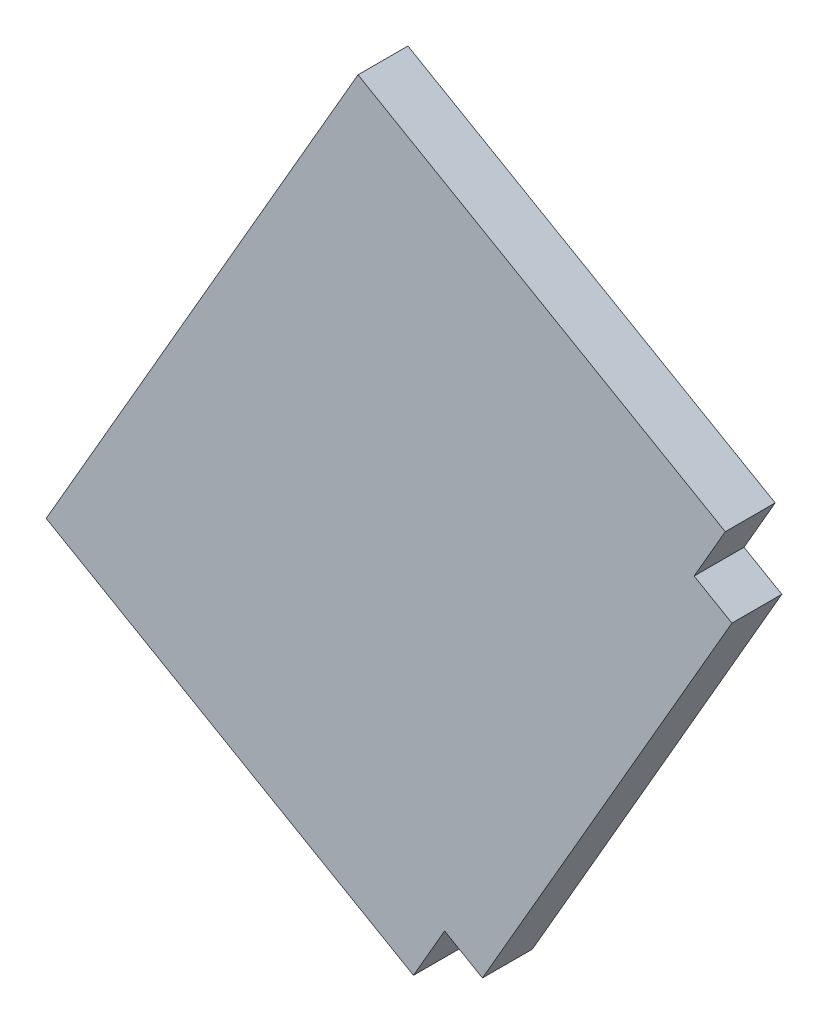
ISO-10303-21;
HEADER;
FILE_DESCRIPTION(('STEP AP214'),'2;1');
FILE_NAME('part.step','',(''),(''),'','','');
FILE_SCHEMA(('AUTOMOTIVE_DESIGN { 1 0 10303 214 1 1 1 1 }'));
ENDSEC;
DATA;
#1=APPLICATION_CONTEXT('core data for automotive mechanical design processes');
#2=APPLICATION_PROTOCOL_DEFINITION('international standard','automotive_design',2000,#1);
#3=PRODUCT_CONTEXT('',#1,'mechanical');
#4=PRODUCT('Part','Part','',(#3));
#5=PRODUCT_RELATED_PRODUCT_CATEGORY('part','',(#4));
#6=PRODUCT_DEFINITION_FORMATION('','',#4);
#7=PRODUCT_DEFINITION_CONTEXT('part definition',#1,'design');
#8=PRODUCT_DEFINITION('design','',#6,#7);
#9=PRODUCT_DEFINITION_SHAPE('','',#8);
#10=(LENGTH_UNIT() NAMED_UNIT(*) SI_UNIT(.MILLI.,.METRE.));
#11=(NAMED_UNIT(*) PLANE_ANGLE_UNIT() SI_UNIT($,.RADIAN.));
#12=(NAMED_UNIT(*) SI_UNIT($,.STERADIAN.) SOLID_ANGLE_UNIT());
#13=UNCERTAINTY_MEASURE_WITH_UNIT(LENGTH_MEASURE(1.E-05),#10,'distance_accuracy_value','');
#14=(GEOMETRIC_REPRESENTATION_CONTEXT(3) GLOBAL_UNCERTAINTY_ASSIGNED_CONTEXT((#13)) GLOBAL_UNIT_ASSIGNED_CONTEXT((#10,
#11,#12)) REPRESENTATION_CONTEXT('',''));
#15=CARTESIAN_POINT('',(0.,0.,0.));
#16=DIRECTION('',(0.,0.,1.));
#17=DIRECTION('',(1.,0.,0.));
#18=AXIS2_PLACEMENT_3D('',#15,#16,#17);
#19=CARTESIAN_POINT('',(-1.92664718204935,0.535,0.));
#20=DIRECTION('',(0.866025403784438,-0.500000000000001,0.));
#21=DIRECTION('',(0.500000000000001,0.866025403784438,0.));
#22=AXIS2_PLACEMENT_3D('',#19,#20,#21);
#23=PLANE('',#22);
#24=DIRECTION('',(0.500000000000001,0.866025403784438,0.));
#25=VECTOR('',#24,1.);
#26=CARTESIAN_POINT('',(-1.92664718204935,0.535,0.08));
#27=LINE('',#26,#25);
#28=CARTESIAN_POINT('',(-1.92664718204935,0.535,0.08));
#29=VERTEX_POINT('',#28);
#30=CARTESIAN_POINT('',(-1.87664718204935,0.621602540378444,0.08));
#31=VERTEX_POINT('',#30);
#32=EDGE_CURVE('E130',#29,#31,#27,.T.);
#33=ORIENTED_EDGE('',*,*,#32,.F.);
#34=DIRECTION('',(0.,0.,1.));
#35=VECTOR('',#34,1.);
#36=CARTESIAN_POINT('',(-1.92664718204935,0.535,0.));
#37=LINE('',#36,#35);
#38=CARTESIAN_POINT('',(-1.92664718204935,0.535,0.));
#39=VERTEX_POINT('',#38);
#40=EDGE_CURVE('E11',#39,#29,#37,.T.);
#41=ORIENTED_EDGE('',*,*,#40,.F.);
#42=DIRECTION('',(0.500000000000001,0.866025403784438,0.));
#43=VECTOR('',#42,1.);
#44=CARTESIAN_POINT('',(-1.92664718204935,0.535,0.));
#45=LINE('',#44,#43);
#46=CARTESIAN_POINT('',(-1.87664718204935,0.621602540378444,0.));
#47=VERTEX_POINT('',#46);
#48=EDGE_CURVE('E150',#39,#47,#45,.T.);
#49=ORIENTED_EDGE('',*,*,#48,.T.);
#50=DIRECTION('',(0.,0.,1.));
#51=VECTOR('',#50,1.);
#52=CARTESIAN_POINT('',(-1.87664718204935,0.621602540378444,0.));
#53=LINE('',#52,#51);
#54=EDGE_CURVE('E36',#47,#31,#53,.T.);
#55=ORIENTED_EDGE('',*,*,#54,.T.);
#56=EDGE_LOOP('',(#33,#41,#49,#55));
#57=FACE_BOUND('',#56,.T.);
#58=ADVANCED_FACE('F33',(#57),#23,.T.);
#59=CARTESIAN_POINT('',(-1.92664718204935,0.535,0.));
#60=DIRECTION('',(-0.5,-0.866025403784439,0.));
#61=DIRECTION('',(0.866025403784439,-0.5,0.));
#62=AXIS2_PLACEMENT_3D('',#59,#60,#61);
#63=PLANE('',#62);
#64=DIRECTION('',(0.866025403784439,-0.5,0.));
#65=VECTOR('',#64,1.);
#66=CARTESIAN_POINT('',(-1.92664718204935,0.535,0.08));
#67=LINE('',#66,#65);
#68=CARTESIAN_POINT('',(-2.51554445662277,0.875,0.08));
#69=VERTEX_POINT('',#68);
#70=EDGE_CURVE('E148',#69,#29,#67,.T.);
#71=ORIENTED_EDGE('',*,*,#70,.F.);
#72=DIRECTION('',(0.,0.,1.));
#73=VECTOR('',#72,1.);
#74=CARTESIAN_POINT('',(-2.51554445662277,0.875,0.));
#75=LINE('',#74,#73);
#76=CARTESIAN_POINT('',(-2.51554445662277,0.875,0.));
#77=VERTEX_POINT('',#76);
#78=EDGE_CURVE('E42',#77,#69,#75,.T.);
#79=ORIENTED_EDGE('',*,*,#78,.F.);
#80=DIRECTION('',(0.866025403784439,-0.5,0.));
#81=VECTOR('',#80,1.);
#82=CARTESIAN_POINT('',(-1.92664718204935,0.535,0.));
#83=LINE('',#82,#81);
#84=EDGE_CURVE('E120',#77,#39,#83,.T.);
#85=ORIENTED_EDGE('',*,*,#84,.T.);
#86=ORIENTED_EDGE('',*,*,#40,.T.);
#87=EDGE_LOOP('',(#71,#79,#85,#86));
#88=FACE_BOUND('',#87,.T.);
#89=ADVANCED_FACE('F162',(#88),#63,.T.);
#90=CARTESIAN_POINT('',(-2.01554445662277,1.74102540378444,0.));
#91=DIRECTION('',(-0.866025403784439,0.5,0.));
#92=DIRECTION('',(-0.5,-0.866025403784439,0.));
#93=AXIS2_PLACEMENT_3D('',#90,#91,#92);
#94=PLANE('',#93);
#95=DIRECTION('',(-0.5,-0.866025403784439,0.));
#96=VECTOR('',#95,1.);
#97=CARTESIAN_POINT('',(-2.01554445662277,1.74102540378444,0.08));
#98=LINE('',#97,#96);
#99=CARTESIAN_POINT('',(-2.01554445662277,1.74102540378444,0.08));
#100=VERTEX_POINT('',#99);
#101=EDGE_CURVE('E107',#100,#69,#98,.T.);
#102=ORIENTED_EDGE('',*,*,#101,.F.);
#103=DIRECTION('',(0.,0.,1.));
#104=VECTOR('',#103,1.);
#105=CARTESIAN_POINT('',(-2.01554445662277,1.74102540378444,0.));
#106=LINE('',#105,#104);
#107=CARTESIAN_POINT('',(-2.01554445662277,1.74102540378444,0.));
#108=VERTEX_POINT('',#107);
#109=EDGE_CURVE('E102',#108,#100,#106,.T.);
#110=ORIENTED_EDGE('',*,*,#109,.F.);
#111=DIRECTION('',(-0.5,-0.866025403784439,0.));
#112=VECTOR('',#111,1.);
#113=CARTESIAN_POINT('',(-2.01554445662277,1.74102540378444,0.));
#114=LINE('',#113,#112);
#115=EDGE_CURVE('E105',#108,#77,#114,.T.);
#116=ORIENTED_EDGE('',*,*,#115,.T.);
#117=ORIENTED_EDGE('',*,*,#78,.T.);
#118=EDGE_LOOP('',(#102,#110,#116,#117));
#119=FACE_BOUND('',#118,.T.);
#120=ADVANCED_FACE('F104',(#119),#94,.T.);
#121=CARTESIAN_POINT('',(-1.42664718204935,1.40102540378444,0.));
#122=DIRECTION('',(0.500000000000002,0.866025403784437,0.));
#123=DIRECTION('',(-0.866025403784438,0.500000000000002,0.));
#124=AXIS2_PLACEMENT_3D('',#121,#122,#123);
#125=PLANE('',#124);
#126=DIRECTION('',(-0.866025403784437,0.500000000000002,0.));
#127=VECTOR('',#126,1.);
#128=CARTESIAN_POINT('',(-1.42664718204935,1.40102540378444,0.08));
#129=LINE('',#128,#127);
#130=CARTESIAN_POINT('',(-1.42664718204935,1.40102540378444,0.08));
#131=VERTEX_POINT('',#130);
#132=EDGE_CURVE('E145',#131,#100,#129,.T.);
#133=ORIENTED_EDGE('',*,*,#132,.F.);
#134=DIRECTION('',(0.,0.,1.));
#135=VECTOR('',#134,1.);
#136=CARTESIAN_POINT('',(-1.42664718204935,1.40102540378444,0.));
#137=LINE('',#136,#135);
#138=CARTESIAN_POINT('',(-1.42664718204935,1.40102540378444,0.));
#139=VERTEX_POINT('',#138);
#140=EDGE_CURVE('E112',#139,#131,#137,.T.);
#141=ORIENTED_EDGE('',*,*,#140,.F.);
#142=DIRECTION('',(-0.866025403784437,0.500000000000002,0.));
#143=VECTOR('',#142,1.);
#144=CARTESIAN_POINT('',(-1.42664718204935,1.40102540378444,0.));
#145=LINE('',#144,#143);
#146=EDGE_CURVE('E118',#139,#108,#145,.T.);
#147=ORIENTED_EDGE('',*,*,#146,.T.);
#148=ORIENTED_EDGE('',*,*,#109,.T.);
#149=EDGE_LOOP('',(#133,#141,#147,#148));
#150=FACE_BOUND('',#149,.T.);
#151=ADVANCED_FACE('F122',(#150),#125,.T.);
#152=CARTESIAN_POINT('',(-1.42664718204935,1.40102540378444,0.));
#153=DIRECTION('',(0.866025403784439,-0.499999999999999,0.));
#154=DIRECTION('',(0.499999999999999,0.866025403784439,0.));
#155=AXIS2_PLACEMENT_3D('',#152,#153,#154);
#156=PLANE('',#155);
#157=DIRECTION('',(0.499999999999999,0.866025403784439,0.));
#158=VECTOR('',#157,1.);
#159=CARTESIAN_POINT('',(-1.42664718204935,1.40102540378444,0.08));
#160=LINE('',#159,#158);
#161=CARTESIAN_POINT('',(-1.47664718204935,1.31442286340599,0.08));
#162=VERTEX_POINT('',#161);
#163=EDGE_CURVE('E142',#162,#131,#160,.T.);
#164=ORIENTED_EDGE('',*,*,#163,.F.);
#165=DIRECTION('',(0.,0.,1.));
#166=VECTOR('',#165,1.);
#167=CARTESIAN_POINT('',(-1.47664718204935,1.31442286340599,0.));
#168=LINE('',#167,#166);
#169=CARTESIAN_POINT('',(-1.47664718204935,1.31442286340599,0.));
#170=VERTEX_POINT('',#169);
#171=EDGE_CURVE('E154',#170,#162,#168,.T.);
#172=ORIENTED_EDGE('',*,*,#171,.F.);
#173=DIRECTION('',(0.499999999999999,0.866025403784439,0.));
#174=VECTOR('',#173,1.);
#175=CARTESIAN_POINT('',(-1.42664718204935,1.40102540378444,0.));
#176=LINE('',#175,#174);
#177=EDGE_CURVE('E123',#170,#139,#176,.T.);
#178=ORIENTED_EDGE('',*,*,#177,.T.);
#179=ORIENTED_EDGE('',*,*,#140,.T.);
#180=EDGE_LOOP('',(#164,#172,#178,#179));
#181=FACE_BOUND('',#180,.T.);
#182=ADVANCED_FACE('F175',(#181),#156,.T.);
#183=CARTESIAN_POINT('',(-1.47664718204935,1.31442286340599,0.));
#184=DIRECTION('',(0.499999999999999,0.866025403784439,0.));
#185=DIRECTION('',(-0.866025403784439,0.499999999999999,0.));
#186=AXIS2_PLACEMENT_3D('',#183,#184,#185);
#187=PLANE('',#186);
#188=DIRECTION('',(-0.866025403784439,0.499999999999999,0.));
#189=VECTOR('',#188,1.);
#190=CARTESIAN_POINT('',(-1.47664718204935,1.31442286340599,0.08));
#191=LINE('',#190,#189);
#192=CARTESIAN_POINT('',(-1.41602540378444,1.27942286340599,0.08));
#193=VERTEX_POINT('',#192);
#194=EDGE_CURVE('E139',#193,#162,#191,.T.);
#195=ORIENTED_EDGE('',*,*,#194,.F.);
#196=DIRECTION('',(0.,0.,1.));
#197=VECTOR('',#196,1.);
#198=CARTESIAN_POINT('',(-1.41602540378444,1.27942286340599,0.));
#199=LINE('',#198,#197);
#200=CARTESIAN_POINT('',(-1.41602540378444,1.27942286340599,0.));
#201=VERTEX_POINT('',#200);
#202=EDGE_CURVE('E156',#201,#193,#199,.T.);
#203=ORIENTED_EDGE('',*,*,#202,.F.);
#204=DIRECTION('',(-0.866025403784439,0.499999999999999,0.));
#205=VECTOR('',#204,1.);
#206=CARTESIAN_POINT('',(-1.47664718204935,1.31442286340599,0.));
#207=LINE('',#206,#205);
#208=EDGE_CURVE('E125',#201,#170,#207,.T.);
#209=ORIENTED_EDGE('',*,*,#208,.T.);
#210=ORIENTED_EDGE('',*,*,#171,.T.);
#211=EDGE_LOOP('',(#195,#203,#209,#210));
#212=FACE_BOUND('',#211,.T.);
#213=ADVANCED_FACE('F178',(#212),#187,.T.);
#214=CARTESIAN_POINT('',(-1.41602540378444,1.27942286340599,0.));
#215=DIRECTION('',(0.866025403784439,-0.5,0.));
#216=DIRECTION('',(0.5,0.866025403784439,0.));
#217=AXIS2_PLACEMENT_3D('',#214,#215,#216);
#218=PLANE('',#217);
#219=DIRECTION('',(0.5,0.866025403784439,0.));
#220=VECTOR('',#219,1.);
#221=CARTESIAN_POINT('',(-1.41602540378444,1.27942286340599,0.08));
#222=LINE('',#221,#220);
#223=CARTESIAN_POINT('',(-1.81602540378444,0.586602540378444,0.08));
#224=VERTEX_POINT('',#223);
#225=EDGE_CURVE('E136',#224,#193,#222,.T.);
#226=ORIENTED_EDGE('',*,*,#225,.F.);
#227=DIRECTION('',(0.,0.,1.));
#228=VECTOR('',#227,1.);
#229=CARTESIAN_POINT('',(-1.81602540378444,0.586602540378444,0.));
#230=LINE('',#229,#228);
#231=CARTESIAN_POINT('',(-1.81602540378444,0.586602540378444,0.));
#232=VERTEX_POINT('',#231);
#233=EDGE_CURVE('E157',#232,#224,#230,.T.);
#234=ORIENTED_EDGE('',*,*,#233,.F.);
#235=DIRECTION('',(0.5,0.866025403784439,0.));
#236=VECTOR('',#235,1.);
#237=CARTESIAN_POINT('',(-1.41602540378444,1.27942286340599,0.));
#238=LINE('',#237,#236);
#239=EDGE_CURVE('E259',#232,#201,#238,.T.);
#240=ORIENTED_EDGE('',*,*,#239,.T.);
#241=ORIENTED_EDGE('',*,*,#202,.T.);
#242=EDGE_LOOP('',(#226,#234,#240,#241));
#243=FACE_BOUND('',#242,.T.);
#244=ADVANCED_FACE('F182',(#243),#218,.T.);
#245=CARTESIAN_POINT('',(-1.87664718204935,0.621602540378444,0.));
#246=DIRECTION('',(-0.5,-0.866025403784439,0.));
#247=DIRECTION('',(0.866025403784439,-0.5,0.));
#248=AXIS2_PLACEMENT_3D('',#245,#246,#247);
#249=PLANE('',#248);
#250=DIRECTION('',(0.866025403784439,-0.5,0.));
#251=VECTOR('',#250,1.);
#252=CARTESIAN_POINT('',(-1.87664718204935,0.621602540378444,0.08));
#253=LINE('',#252,#251);
#254=EDGE_CURVE('E133',#31,#224,#253,.T.);
#255=ORIENTED_EDGE('',*,*,#254,.F.);
#256=ORIENTED_EDGE('',*,*,#54,.F.);
#257=DIRECTION('',(0.866025403784439,-0.5,0.));
#258=VECTOR('',#257,1.);
#259=CARTESIAN_POINT('',(-1.87664718204935,0.621602540378444,0.));
#260=LINE('',#259,#258);
#261=EDGE_CURVE('E260',#47,#232,#260,.T.);
#262=ORIENTED_EDGE('',*,*,#261,.T.);
#263=ORIENTED_EDGE('',*,*,#233,.T.);
#264=EDGE_LOOP('',(#255,#256,#262,#263));
#265=FACE_BOUND('',#264,.T.);
#266=ADVANCED_FACE('F159',(#265),#249,.T.);
#267=CARTESIAN_POINT('',(0.,0.,0.));
#268=DIRECTION('',(0.,0.,-1.));
#269=DIRECTION('',(-1.,0.,0.));
#270=AXIS2_PLACEMENT_3D('',#267,#268,#269);
#271=PLANE('',#270);
#272=ORIENTED_EDGE('',*,*,#48,.F.);
#273=ORIENTED_EDGE('',*,*,#84,.F.);
#274=ORIENTED_EDGE('',*,*,#115,.F.);
#275=ORIENTED_EDGE('',*,*,#146,.F.);
#276=ORIENTED_EDGE('',*,*,#177,.F.);
#277=ORIENTED_EDGE('',*,*,#208,.F.);
#278=ORIENTED_EDGE('',*,*,#239,.F.);
#279=ORIENTED_EDGE('',*,*,#261,.F.);
#280=EDGE_LOOP('',(#272,#273,#274,#275,#276,#277,#278,#279));
#281=FACE_BOUND('',#280,.T.);
#282=ADVANCED_FACE('F116',(#281),#271,.T.);
#283=CARTESIAN_POINT('',(0.,0.,0.08));
#284=DIRECTION('',(0.,0.,-1.));
#285=DIRECTION('',(-1.,0.,0.));
#286=AXIS2_PLACEMENT_3D('',#283,#284,#285);
#287=PLANE('',#286);
#288=ORIENTED_EDGE('',*,*,#32,.T.);
#289=ORIENTED_EDGE('',*,*,#254,.T.);
#290=ORIENTED_EDGE('',*,*,#225,.T.);
#291=ORIENTED_EDGE('',*,*,#194,.T.);
#292=ORIENTED_EDGE('',*,*,#163,.T.);
#293=ORIENTED_EDGE('',*,*,#132,.T.);
#294=ORIENTED_EDGE('',*,*,#101,.T.);
#295=ORIENTED_EDGE('',*,*,#70,.T.);
#296=EDGE_LOOP('',(#288,#289,#290,#291,#292,#293,#294,#295));
#297=FACE_BOUND('',#296,.T.);
#298=ADVANCED_FACE('F161',(#297),#287,.F.);
#299=CLOSED_SHELL('',(#58,#89,#120,#151,#182,#213,#244,#266,#282,#298));
#300=MANIFOLD_SOLID_BREP('B2',#299);
#301=ADVANCED_BREP_SHAPE_REPRESENTATION('',(#18,#300),#14);
#302=SHAPE_DEFINITION_REPRESENTATION(#9,#301);
ENDSEC;
END-ISO-10303-21;
